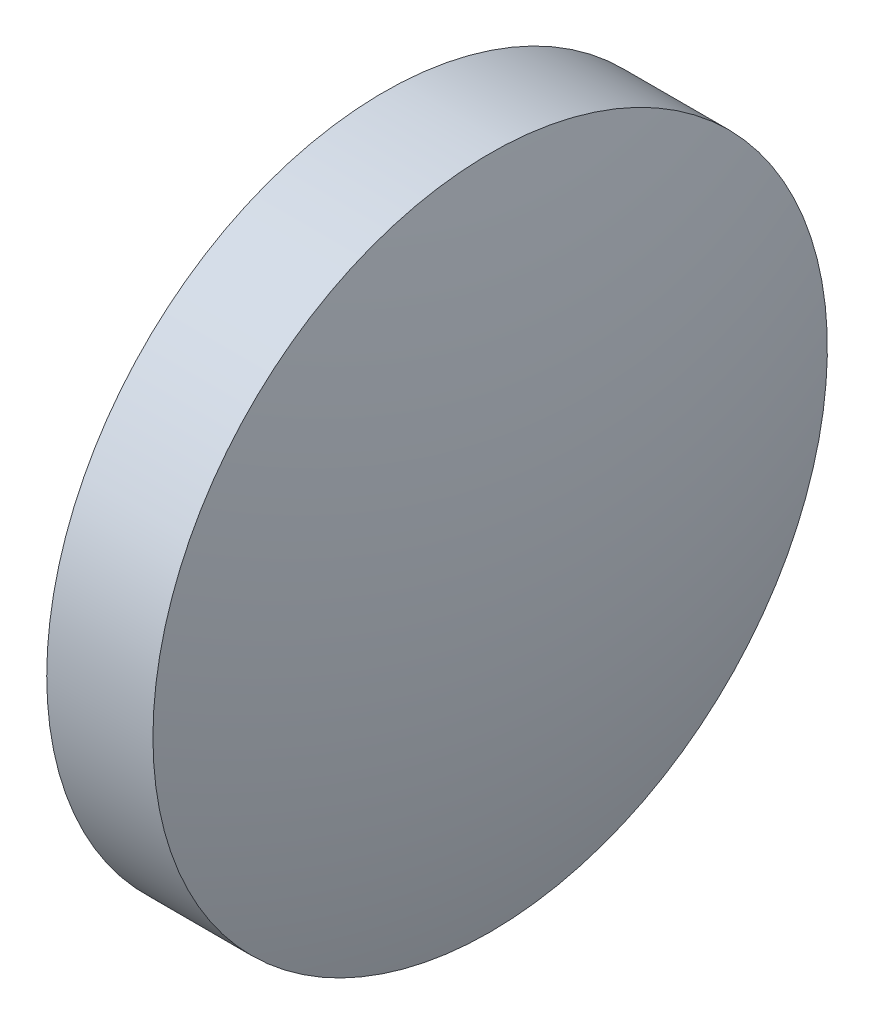
ISO-10303-21;
HEADER;
FILE_DESCRIPTION(('STEP AP214'),'2;1');
FILE_NAME('part.step','',(''),(''),'','','');
FILE_SCHEMA(('AUTOMOTIVE_DESIGN { 1 0 10303 214 1 1 1 1 }'));
ENDSEC;
DATA;
#1=APPLICATION_CONTEXT('core data for automotive mechanical design processes');
#2=APPLICATION_PROTOCOL_DEFINITION('international standard','automotive_design',2000,#1);
#3=PRODUCT_CONTEXT('',#1,'mechanical');
#4=PRODUCT('Part','Part','',(#3));
#5=PRODUCT_RELATED_PRODUCT_CATEGORY('part','',(#4));
#6=PRODUCT_DEFINITION_FORMATION('','',#4);
#7=PRODUCT_DEFINITION_CONTEXT('part definition',#1,'design');
#8=PRODUCT_DEFINITION('design','',#6,#7);
#9=PRODUCT_DEFINITION_SHAPE('','',#8);
#10=(LENGTH_UNIT() NAMED_UNIT(*) SI_UNIT(.MILLI.,.METRE.));
#11=(NAMED_UNIT(*) PLANE_ANGLE_UNIT() SI_UNIT($,.RADIAN.));
#12=(NAMED_UNIT(*) SI_UNIT($,.STERADIAN.) SOLID_ANGLE_UNIT());
#13=UNCERTAINTY_MEASURE_WITH_UNIT(LENGTH_MEASURE(1.E-05),#10,'distance_accuracy_value','');
#14=(GEOMETRIC_REPRESENTATION_CONTEXT(3) GLOBAL_UNCERTAINTY_ASSIGNED_CONTEXT((#13)) GLOBAL_UNIT_ASSIGNED_CONTEXT((#10,
#11,#12)) REPRESENTATION_CONTEXT('',''));
#15=CARTESIAN_POINT('',(0.,0.,0.));
#16=DIRECTION('',(0.,0.,1.));
#17=DIRECTION('',(1.,0.,0.));
#18=AXIS2_PLACEMENT_3D('',#15,#16,#17);
#19=CARTESIAN_POINT('',(420.775923495798,-5.12945931994604,0.));
#20=DIRECTION('',(-1.,0.,0.));
#21=DIRECTION('',(0.,-1.,0.));
#22=AXIS2_PLACEMENT_3D('',#19,#20,#21);
#23=SPHERICAL_SURFACE('',#22,22.8513888888882);
#24=CARTESIAN_POINT('',(442.727312384686,-5.12945931994611,0.));
#25=DIRECTION('',(-1.,0.,0.));
#26=DIRECTION('',(0.,0.,1.));
#27=AXIS2_PLACEMENT_3D('',#24,#25,#26);
#28=CIRCLE('',#27,6.35);
#29=CARTESIAN_POINT('',(442.727312384686,-5.12945931994611,6.35));
#30=VERTEX_POINT('',#29);
#31=EDGE_CURVE('E10',#30,#30,#28,.T.);
#32=ORIENTED_EDGE('',*,*,#31,.F.);
#33=EDGE_LOOP('',(#32));
#34=FACE_BOUND('',#33,.T.);
#35=ADVANCED_FACE('F35',(#34),#23,.T.);
#36=CARTESIAN_POINT('',(438.399283894692,-5.12945931994611,0.));
#37=DIRECTION('',(-1.,0.,0.));
#38=DIRECTION('',(0.,0.,1.));
#39=AXIS2_PLACEMENT_3D('',#36,#37,#38);
#40=CYLINDRICAL_SURFACE('',#39,6.35);
#41=CARTESIAN_POINT('',(440.727312384686,-5.12945931994611,0.));
#42=DIRECTION('',(-1.,0.,0.));
#43=DIRECTION('',(0.,0.,1.));
#44=AXIS2_PLACEMENT_3D('',#41,#42,#43);
#45=CIRCLE('',#44,6.35);
#46=CARTESIAN_POINT('',(440.727312384686,-5.12945931994611,6.35));
#47=VERTEX_POINT('',#46);
#48=EDGE_CURVE('E41',#47,#47,#45,.T.);
#49=ORIENTED_EDGE('',*,*,#48,.F.);
#50=EDGE_LOOP('',(#49));
#51=FACE_BOUND('',#50,.T.);
#52=ORIENTED_EDGE('',*,*,#31,.T.);
#53=EDGE_LOOP('',(#52));
#54=FACE_BOUND('',#53,.T.);
#55=ADVANCED_FACE('F49',(#51,#54),#40,.T.);
#56=CARTESIAN_POINT('',(440.727312384686,-5.12945931994611,0.));
#57=DIRECTION('',(1.,0.,0.));
#58=DIRECTION('',(0.,0.,-1.));
#59=AXIS2_PLACEMENT_3D('',#56,#57,#58);
#60=PLANE('',#59);
#61=ORIENTED_EDGE('',*,*,#48,.T.);
#62=EDGE_LOOP('',(#61));
#63=FACE_BOUND('',#62,.T.);
#64=ADVANCED_FACE('F47',(#63),#60,.F.);
#65=CLOSED_SHELL('',(#35,#55,#64));
#66=MANIFOLD_SOLID_BREP('B2',#65);
#67=ADVANCED_BREP_SHAPE_REPRESENTATION('',(#18,#66),#14);
#68=SHAPE_DEFINITION_REPRESENTATION(#9,#67);
ENDSEC;
END-ISO-10303-21;
